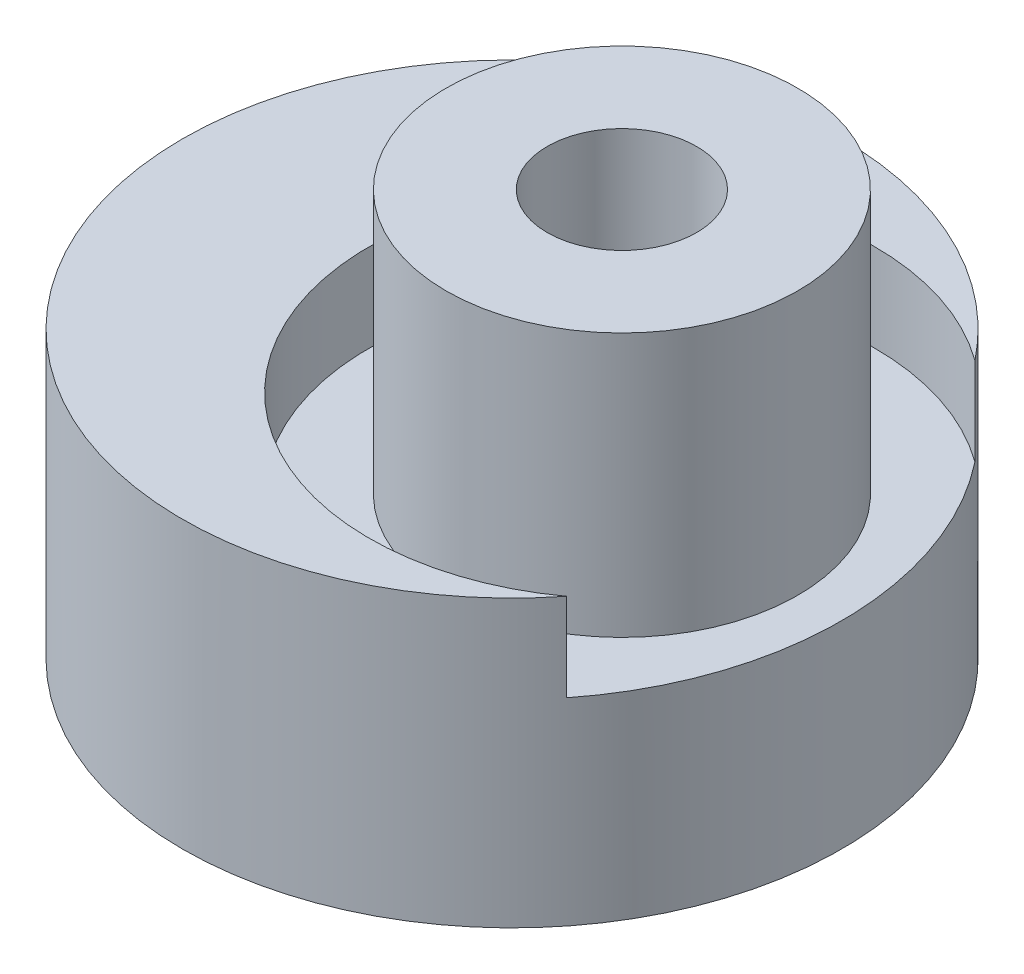
ISO-10303-21;
HEADER;
FILE_DESCRIPTION(('STEP AP214'),'2;1');
FILE_NAME('part.step','',(''),(''),'','','');
FILE_SCHEMA(('AUTOMOTIVE_DESIGN { 1 0 10303 214 1 1 1 1 }'));
ENDSEC;
DATA;
#1=APPLICATION_CONTEXT('core data for automotive mechanical design processes');
#2=APPLICATION_PROTOCOL_DEFINITION('international standard','automotive_design',2000,#1);
#3=PRODUCT_CONTEXT('',#1,'mechanical');
#4=PRODUCT('Part','Part','',(#3));
#5=PRODUCT_RELATED_PRODUCT_CATEGORY('part','',(#4));
#6=PRODUCT_DEFINITION_FORMATION('','',#4);
#7=PRODUCT_DEFINITION_CONTEXT('part definition',#1,'design');
#8=PRODUCT_DEFINITION('design','',#6,#7);
#9=PRODUCT_DEFINITION_SHAPE('','',#8);
#10=(LENGTH_UNIT() NAMED_UNIT(*) SI_UNIT(.MILLI.,.METRE.));
#11=(NAMED_UNIT(*) PLANE_ANGLE_UNIT() SI_UNIT($,.RADIAN.));
#12=(NAMED_UNIT(*) SI_UNIT($,.STERADIAN.) SOLID_ANGLE_UNIT());
#13=UNCERTAINTY_MEASURE_WITH_UNIT(LENGTH_MEASURE(1.E-05),#10,'distance_accuracy_value','');
#14=(GEOMETRIC_REPRESENTATION_CONTEXT(3) GLOBAL_UNCERTAINTY_ASSIGNED_CONTEXT((#13)) GLOBAL_UNIT_ASSIGNED_CONTEXT((#10,
#11,#12)) REPRESENTATION_CONTEXT('',''));
#15=CARTESIAN_POINT('',(0.,0.,0.));
#16=DIRECTION('',(0.,0.,1.));
#17=DIRECTION('',(1.,0.,0.));
#18=AXIS2_PLACEMENT_3D('',#15,#16,#17);
#19=CARTESIAN_POINT('',(0.,6.5,0.));
#20=DIRECTION('',(0.,-1.,0.));
#21=DIRECTION('',(0.,0.,-1.));
#22=AXIS2_PLACEMENT_3D('',#19,#20,#21);
#23=CYLINDRICAL_SURFACE('',#22,1.8);
#24=CARTESIAN_POINT('',(0.,6.5,0.));
#25=DIRECTION('',(0.,1.,0.));
#26=DIRECTION('',(0.,0.,1.));
#27=AXIS2_PLACEMENT_3D('',#24,#25,#26);
#28=CIRCLE('',#27,1.8);
#29=CARTESIAN_POINT('',(0.,6.5,1.8));
#30=VERTEX_POINT('',#29);
#31=EDGE_CURVE('E100',#30,#30,#28,.T.);
#32=ORIENTED_EDGE('',*,*,#31,.T.);
#33=EDGE_LOOP('',(#32));
#34=FACE_BOUND('',#33,.T.);
#35=CARTESIAN_POINT('',(0.,3.5,0.));
#36=DIRECTION('',(0.,-1.,0.));
#37=DIRECTION('',(0.,0.,-1.));
#38=AXIS2_PLACEMENT_3D('',#35,#36,#37);
#39=CIRCLE('',#38,1.8);
#40=CARTESIAN_POINT('',(0.,3.5,-1.8));
#41=VERTEX_POINT('',#40);
#42=EDGE_CURVE('E81',#41,#41,#39,.T.);
#43=ORIENTED_EDGE('',*,*,#42,.T.);
#44=EDGE_LOOP('',(#43));
#45=FACE_BOUND('',#44,.T.);
#46=ADVANCED_FACE('F34',(#34,#45),#23,.F.);
#47=CARTESIAN_POINT('',(-2.5,0.,0.));
#48=DIRECTION('',(0.,1.,0.));
#49=DIRECTION('',(0.,0.,1.));
#50=AXIS2_PLACEMENT_3D('',#47,#48,#49);
#51=PLANE('',#50);
#52=CARTESIAN_POINT('',(0.,0.,0.));
#53=DIRECTION('',(0.,1.,0.));
#54=DIRECTION('',(0.,0.,1.));
#55=AXIS2_PLACEMENT_3D('',#52,#53,#54);
#56=CIRCLE('',#55,3.6);
#57=CARTESIAN_POINT('',(0.,0.,3.6));
#58=VERTEX_POINT('',#57);
#59=EDGE_CURVE('E42',#58,#58,#56,.T.);
#60=ORIENTED_EDGE('',*,*,#59,.T.);
#61=EDGE_LOOP('',(#60));
#62=FACE_BOUND('',#61,.T.);
#63=CARTESIAN_POINT('',(-2.5,0.,0.));
#64=DIRECTION('',(0.,1.,0.));
#65=DIRECTION('',(0.,0.,1.));
#66=AXIS2_PLACEMENT_3D('',#63,#64,#65);
#67=CIRCLE('',#66,7.5);
#68=CARTESIAN_POINT('',(-2.5,0.,7.5));
#69=VERTEX_POINT('',#68);
#70=EDGE_CURVE('E77',#69,#69,#67,.T.);
#71=ORIENTED_EDGE('',*,*,#70,.F.);
#72=EDGE_LOOP('',(#71));
#73=FACE_BOUND('',#72,.T.);
#74=ADVANCED_FACE('F110',(#62,#73),#51,.F.);
#75=CARTESIAN_POINT('',(-2.5,3.,0.));
#76=DIRECTION('',(0.,-1.,0.));
#77=DIRECTION('',(0.,0.,-1.));
#78=AXIS2_PLACEMENT_3D('',#75,#76,#77);
#79=CYLINDRICAL_SURFACE('',#78,7.5);
#80=ORIENTED_EDGE('',*,*,#70,.T.);
#81=EDGE_LOOP('',(#80));
#82=FACE_BOUND('',#81,.T.);
#83=CARTESIAN_POINT('',(-2.5,4.5,0.));
#84=DIRECTION('',(0.,1.,0.));
#85=DIRECTION('',(0.,0.,1.));
#86=AXIS2_PLACEMENT_3D('',#83,#84,#85);
#87=CIRCLE('',#86,7.5);
#88=CARTESIAN_POINT('',(3.3875,4.5,4.6462182202303));
#89=VERTEX_POINT('',#88);
#90=CARTESIAN_POINT('',(3.3875,4.5,-4.6462182202303));
#91=VERTEX_POINT('',#90);
#92=EDGE_CURVE('E71',#89,#91,#87,.T.);
#93=ORIENTED_EDGE('',*,*,#92,.F.);
#94=DIRECTION('',(0.,1.,0.));
#95=VECTOR('',#94,1.);
#96=CARTESIAN_POINT('',(3.3875,5.5,4.6462182202303));
#97=LINE('',#96,#95);
#98=CARTESIAN_POINT('',(3.3875,6.5,4.6462182202303));
#99=VERTEX_POINT('',#98);
#100=EDGE_CURVE('E59',#89,#99,#97,.T.);
#101=ORIENTED_EDGE('',*,*,#100,.T.);
#102=CARTESIAN_POINT('',(-2.5,6.5,0.));
#103=DIRECTION('',(0.,1.,0.));
#104=DIRECTION('',(0.,0.,1.));
#105=AXIS2_PLACEMENT_3D('',#102,#103,#104);
#106=CIRCLE('',#105,7.5);
#107=CARTESIAN_POINT('',(3.3875,6.5,-4.6462182202303));
#108=VERTEX_POINT('',#107);
#109=EDGE_CURVE('E67',#108,#99,#106,.T.);
#110=ORIENTED_EDGE('',*,*,#109,.F.);
#111=DIRECTION('',(0.,1.,0.));
#112=VECTOR('',#111,1.);
#113=CARTESIAN_POINT('',(3.3875,5.5,-4.6462182202303));
#114=LINE('',#113,#112);
#115=EDGE_CURVE('E49',#108,#91,#114,.F.);
#116=ORIENTED_EDGE('',*,*,#115,.T.);
#117=EDGE_LOOP('',(#93,#101,#110,#116));
#118=FACE_BOUND('',#117,.T.);
#119=ADVANCED_FACE('F74',(#82,#118),#79,.T.);
#120=CARTESIAN_POINT('',(0.,3.,0.));
#121=DIRECTION('',(0.,-1.,0.));
#122=DIRECTION('',(0.,0.,-1.));
#123=AXIS2_PLACEMENT_3D('',#120,#121,#122);
#124=CYLINDRICAL_SURFACE('',#123,3.);
#125=CARTESIAN_POINT('',(0.,0.600000000000001,0.));
#126=DIRECTION('',(0.,1.,0.));
#127=DIRECTION('',(0.,0.,1.));
#128=AXIS2_PLACEMENT_3D('',#125,#126,#127);
#129=CIRCLE('',#128,3.);
#130=CARTESIAN_POINT('',(0.,0.600000000000001,3.));
#131=VERTEX_POINT('',#130);
#132=EDGE_CURVE('E11',#131,#131,#129,.F.);
#133=ORIENTED_EDGE('',*,*,#132,.T.);
#134=EDGE_LOOP('',(#133));
#135=FACE_BOUND('',#134,.T.);
#136=CARTESIAN_POINT('',(0.,3.5,0.));
#137=DIRECTION('',(0.,-1.,0.));
#138=DIRECTION('',(0.,0.,-1.));
#139=AXIS2_PLACEMENT_3D('',#136,#137,#138);
#140=CIRCLE('',#139,3.);
#141=CARTESIAN_POINT('',(0.,3.5,-3.));
#142=VERTEX_POINT('',#141);
#143=EDGE_CURVE('E84',#142,#142,#140,.T.);
#144=ORIENTED_EDGE('',*,*,#143,.F.);
#145=EDGE_LOOP('',(#144));
#146=FACE_BOUND('',#145,.T.);
#147=ADVANCED_FACE('F118',(#135,#146),#124,.F.);
#148=CARTESIAN_POINT('',(-2.5,6.5,0.));
#149=DIRECTION('',(0.,1.,0.));
#150=DIRECTION('',(0.,0.,1.));
#151=AXIS2_PLACEMENT_3D('',#148,#149,#150);
#152=PLANE('',#151);
#153=CARTESIAN_POINT('',(0.,6.5,0.));
#154=DIRECTION('',(0.,1.,0.));
#155=DIRECTION('',(0.,0.,1.));
#156=AXIS2_PLACEMENT_3D('',#153,#154,#155);
#157=CIRCLE('',#156,5.75);
#158=EDGE_CURVE('E53',#108,#99,#157,.T.);
#159=ORIENTED_EDGE('',*,*,#158,.F.);
#160=ORIENTED_EDGE('',*,*,#109,.T.);
#161=EDGE_LOOP('',(#159,#160));
#162=FACE_BOUND('',#161,.T.);
#163=ADVANCED_FACE('F124',(#162),#152,.T.);
#164=CARTESIAN_POINT('',(0.,4.5,0.));
#165=DIRECTION('',(0.,1.,0.));
#166=DIRECTION('',(0.,0.,1.));
#167=AXIS2_PLACEMENT_3D('',#164,#165,#166);
#168=PLANE('',#167);
#169=CARTESIAN_POINT('',(0.,4.5,0.));
#170=DIRECTION('',(0.,1.,0.));
#171=DIRECTION('',(0.,0.,1.));
#172=AXIS2_PLACEMENT_3D('',#169,#170,#171);
#173=CIRCLE('',#172,4.);
#174=CARTESIAN_POINT('',(0.,4.5,4.));
#175=VERTEX_POINT('',#174);
#176=EDGE_CURVE('E72',#175,#175,#173,.T.);
#177=ORIENTED_EDGE('',*,*,#176,.F.);
#178=EDGE_LOOP('',(#177));
#179=FACE_BOUND('',#178,.T.);
#180=ORIENTED_EDGE('',*,*,#92,.T.);
#181=CARTESIAN_POINT('',(0.,4.5,0.));
#182=DIRECTION('',(0.,1.,0.));
#183=DIRECTION('',(0.,0.,1.));
#184=AXIS2_PLACEMENT_3D('',#181,#182,#183);
#185=CIRCLE('',#184,5.75);
#186=EDGE_CURVE('E62',#91,#89,#185,.T.);
#187=ORIENTED_EDGE('',*,*,#186,.T.);
#188=EDGE_LOOP('',(#180,#187));
#189=FACE_BOUND('',#188,.T.);
#190=ADVANCED_FACE('F70',(#179,#189),#168,.T.);
#191=CARTESIAN_POINT('',(0.,4.5,0.));
#192=DIRECTION('',(0.,1.,0.));
#193=DIRECTION('',(0.,0.,1.));
#194=AXIS2_PLACEMENT_3D('',#191,#192,#193);
#195=CYLINDRICAL_SURFACE('',#194,5.75);
#196=ORIENTED_EDGE('',*,*,#186,.F.);
#197=ORIENTED_EDGE('',*,*,#115,.F.);
#198=ORIENTED_EDGE('',*,*,#158,.T.);
#199=ORIENTED_EDGE('',*,*,#100,.F.);
#200=EDGE_LOOP('',(#196,#197,#198,#199));
#201=FACE_BOUND('',#200,.T.);
#202=ADVANCED_FACE('F61',(#201),#195,.F.);
#203=CARTESIAN_POINT('',(0.,4.5,0.));
#204=DIRECTION('',(0.,1.,0.));
#205=DIRECTION('',(0.,0.,1.));
#206=AXIS2_PLACEMENT_3D('',#203,#204,#205);
#207=CYLINDRICAL_SURFACE('',#206,4.);
#208=ORIENTED_EDGE('',*,*,#176,.T.);
#209=EDGE_LOOP('',(#208));
#210=FACE_BOUND('',#209,.T.);
#211=CARTESIAN_POINT('',(0.,10.5,0.));
#212=DIRECTION('',(0.,1.,0.));
#213=DIRECTION('',(0.,0.,1.));
#214=AXIS2_PLACEMENT_3D('',#211,#212,#213);
#215=CIRCLE('',#214,4.);
#216=CARTESIAN_POINT('',(0.,10.5,4.));
#217=VERTEX_POINT('',#216);
#218=EDGE_CURVE('E96',#217,#217,#215,.T.);
#219=ORIENTED_EDGE('',*,*,#218,.F.);
#220=EDGE_LOOP('',(#219));
#221=FACE_BOUND('',#220,.T.);
#222=ADVANCED_FACE('F131',(#210,#221),#207,.T.);
#223=CARTESIAN_POINT('',(0.,10.5,0.));
#224=DIRECTION('',(0.,1.,0.));
#225=DIRECTION('',(0.,0.,1.));
#226=AXIS2_PLACEMENT_3D('',#223,#224,#225);
#227=PLANE('',#226);
#228=ORIENTED_EDGE('',*,*,#218,.T.);
#229=EDGE_LOOP('',(#228));
#230=FACE_BOUND('',#229,.T.);
#231=CARTESIAN_POINT('',(0.,10.5,0.));
#232=DIRECTION('',(0.,1.,0.));
#233=DIRECTION('',(0.,0.,1.));
#234=AXIS2_PLACEMENT_3D('',#231,#232,#233);
#235=CIRCLE('',#234,1.7);
#236=CARTESIAN_POINT('',(0.,10.5,1.7));
#237=VERTEX_POINT('',#236);
#238=EDGE_CURVE('E88',#237,#237,#235,.T.);
#239=ORIENTED_EDGE('',*,*,#238,.F.);
#240=EDGE_LOOP('',(#239));
#241=FACE_BOUND('',#240,.T.);
#242=ADVANCED_FACE('F137',(#230,#241),#227,.T.);
#243=CARTESIAN_POINT('',(0.,6.5,0.));
#244=DIRECTION('',(0.,1.,0.));
#245=DIRECTION('',(0.,0.,1.));
#246=AXIS2_PLACEMENT_3D('',#243,#244,#245);
#247=PLANE('',#246);
#248=ORIENTED_EDGE('',*,*,#31,.F.);
#249=EDGE_LOOP('',(#248));
#250=FACE_BOUND('',#249,.T.);
#251=CARTESIAN_POINT('',(0.,6.5,0.));
#252=DIRECTION('',(0.,1.,0.));
#253=DIRECTION('',(0.,0.,1.));
#254=AXIS2_PLACEMENT_3D('',#251,#252,#253);
#255=CIRCLE('',#254,1.7);
#256=CARTESIAN_POINT('',(0.,6.5,1.7));
#257=VERTEX_POINT('',#256);
#258=EDGE_CURVE('E83',#257,#257,#255,.T.);
#259=ORIENTED_EDGE('',*,*,#258,.T.);
#260=EDGE_LOOP('',(#259));
#261=FACE_BOUND('',#260,.T.);
#262=ADVANCED_FACE('F139',(#250,#261),#247,.F.);
#263=CARTESIAN_POINT('',(0.,10.5,0.));
#264=DIRECTION('',(0.,-1.,0.));
#265=DIRECTION('',(0.,0.,-1.));
#266=AXIS2_PLACEMENT_3D('',#263,#264,#265);
#267=CYLINDRICAL_SURFACE('',#266,1.7);
#268=ORIENTED_EDGE('',*,*,#238,.T.);
#269=EDGE_LOOP('',(#268));
#270=FACE_BOUND('',#269,.T.);
#271=ORIENTED_EDGE('',*,*,#258,.F.);
#272=EDGE_LOOP('',(#271));
#273=FACE_BOUND('',#272,.T.);
#274=ADVANCED_FACE('F142',(#270,#273),#267,.F.);
#275=CARTESIAN_POINT('',(0.,3.5,0.));
#276=DIRECTION('',(0.,-1.,0.));
#277=DIRECTION('',(0.,0.,-1.));
#278=AXIS2_PLACEMENT_3D('',#275,#276,#277);
#279=PLANE('',#278);
#280=ORIENTED_EDGE('',*,*,#42,.F.);
#281=EDGE_LOOP('',(#280));
#282=FACE_BOUND('',#281,.T.);
#283=ORIENTED_EDGE('',*,*,#143,.T.);
#284=EDGE_LOOP('',(#283));
#285=FACE_BOUND('',#284,.T.);
#286=ADVANCED_FACE('F149',(#282,#285),#279,.T.);
#287=CARTESIAN_POINT('',(0.,0.,0.));
#288=DIRECTION('',(0.,-1.,0.));
#289=DIRECTION('',(0.,0.,-1.));
#290=AXIS2_PLACEMENT_3D('',#287,#288,#289);
#291=CONICAL_SURFACE('',#290,3.6,0.785398163397449);
#292=ORIENTED_EDGE('',*,*,#132,.F.);
#293=EDGE_LOOP('',(#292));
#294=FACE_BOUND('',#293,.T.);
#295=ORIENTED_EDGE('',*,*,#59,.F.);
#296=EDGE_LOOP('',(#295));
#297=FACE_BOUND('',#296,.T.);
#298=ADVANCED_FACE('F36',(#294,#297),#291,.F.);
#299=CLOSED_SHELL('',(#46,#74,#119,#147,#163,#190,#202,#222,#242,#262,#274,#286,#298));
#300=MANIFOLD_SOLID_BREP('B2',#299);
#301=ADVANCED_BREP_SHAPE_REPRESENTATION('',(#18,#300),#14);
#302=SHAPE_DEFINITION_REPRESENTATION(#9,#301);
ENDSEC;
END-ISO-10303-21;
